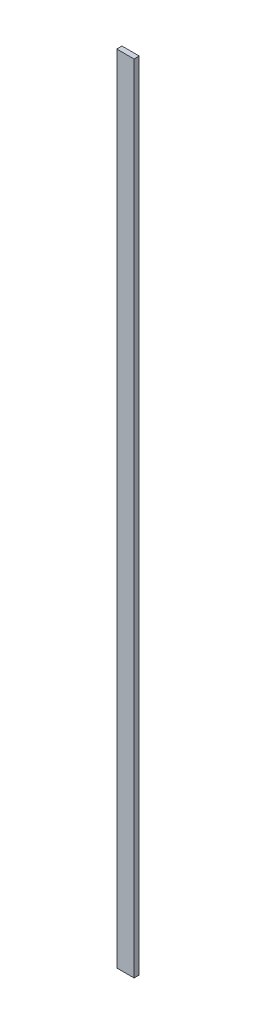
ISO-10303-21;
HEADER;
FILE_DESCRIPTION(('STEP AP214'),'2;1');
FILE_NAME('part.step','',(''),(''),'','','');
FILE_SCHEMA(('AUTOMOTIVE_DESIGN { 1 0 10303 214 1 1 1 1 }'));
ENDSEC;
DATA;
#1=APPLICATION_CONTEXT('core data for automotive mechanical design processes');
#2=APPLICATION_PROTOCOL_DEFINITION('international standard','automotive_design',2000,#1);
#3=PRODUCT_CONTEXT('',#1,'mechanical');
#4=PRODUCT('Part','Part','',(#3));
#5=PRODUCT_RELATED_PRODUCT_CATEGORY('part','',(#4));
#6=PRODUCT_DEFINITION_FORMATION('','',#4);
#7=PRODUCT_DEFINITION_CONTEXT('part definition',#1,'design');
#8=PRODUCT_DEFINITION('design','',#6,#7);
#9=PRODUCT_DEFINITION_SHAPE('','',#8);
#10=(LENGTH_UNIT() NAMED_UNIT(*) SI_UNIT(.MILLI.,.METRE.));
#11=(NAMED_UNIT(*) PLANE_ANGLE_UNIT() SI_UNIT($,.RADIAN.));
#12=(NAMED_UNIT(*) SI_UNIT($,.STERADIAN.) SOLID_ANGLE_UNIT());
#13=UNCERTAINTY_MEASURE_WITH_UNIT(LENGTH_MEASURE(1.E-05),#10,'distance_accuracy_value','');
#14=(GEOMETRIC_REPRESENTATION_CONTEXT(3) GLOBAL_UNCERTAINTY_ASSIGNED_CONTEXT((#13)) GLOBAL_UNIT_ASSIGNED_CONTEXT((#10,
#11,#12)) REPRESENTATION_CONTEXT('',''));
#15=CARTESIAN_POINT('',(0.,0.,0.));
#16=DIRECTION('',(0.,0.,1.));
#17=DIRECTION('',(1.,0.,0.));
#18=AXIS2_PLACEMENT_3D('',#15,#16,#17);
#19=CARTESIAN_POINT('',(-33.908474102077,12.9449766126216,3.));
#20=DIRECTION('',(0.,-1.,0.));
#21=DIRECTION('',(0.,0.,-1.));
#22=AXIS2_PLACEMENT_3D('',#19,#20,#21);
#23=PLANE('',#22);
#24=DIRECTION('',(-1.,0.,0.));
#25=VECTOR('',#24,1.);
#26=CARTESIAN_POINT('',(-33.908474102077,12.9449766126216,0.));
#27=LINE('',#26,#25);
#28=CARTESIAN_POINT('',(-23.908474102077,12.9449766126216,0.));
#29=VERTEX_POINT('',#28);
#30=CARTESIAN_POINT('',(-33.908474102077,12.9449766126216,0.));
#31=VERTEX_POINT('',#30);
#32=EDGE_CURVE('E96',#29,#31,#27,.T.);
#33=ORIENTED_EDGE('',*,*,#32,.T.);
#34=DIRECTION('',(0.,0.,-1.));
#35=VECTOR('',#34,1.);
#36=CARTESIAN_POINT('',(-33.908474102077,12.9449766126216,3.));
#37=LINE('',#36,#35);
#38=CARTESIAN_POINT('',(-33.908474102077,12.9449766126216,3.));
#39=VERTEX_POINT('',#38);
#40=EDGE_CURVE('E11',#39,#31,#37,.T.);
#41=ORIENTED_EDGE('',*,*,#40,.F.);
#42=DIRECTION('',(-1.,0.,0.));
#43=VECTOR('',#42,1.);
#44=CARTESIAN_POINT('',(-33.908474102077,12.9449766126216,3.));
#45=LINE('',#44,#43);
#46=CARTESIAN_POINT('',(-23.908474102077,12.9449766126216,3.));
#47=VERTEX_POINT('',#46);
#48=EDGE_CURVE('E84',#47,#39,#45,.T.);
#49=ORIENTED_EDGE('',*,*,#48,.F.);
#50=DIRECTION('',(0.,0.,-1.));
#51=VECTOR('',#50,1.);
#52=CARTESIAN_POINT('',(-23.908474102077,12.9449766126216,3.));
#53=LINE('',#52,#51);
#54=EDGE_CURVE('E92',#47,#29,#53,.T.);
#55=ORIENTED_EDGE('',*,*,#54,.T.);
#56=EDGE_LOOP('',(#33,#41,#49,#55));
#57=FACE_BOUND('',#56,.T.);
#58=ADVANCED_FACE('F33',(#57),#23,.F.);
#59=CARTESIAN_POINT('',(-33.908474102077,-447.055023387378,3.));
#60=DIRECTION('',(1.,0.,0.));
#61=DIRECTION('',(0.,1.,0.));
#62=AXIS2_PLACEMENT_3D('',#59,#60,#61);
#63=PLANE('',#62);
#64=DIRECTION('',(0.,-1.,0.));
#65=VECTOR('',#64,1.);
#66=CARTESIAN_POINT('',(-33.908474102077,-447.055023387378,0.));
#67=LINE('',#66,#65);
#68=CARTESIAN_POINT('',(-33.908474102077,-447.055023387378,0.));
#69=VERTEX_POINT('',#68);
#70=EDGE_CURVE('E88',#31,#69,#67,.T.);
#71=ORIENTED_EDGE('',*,*,#70,.T.);
#72=DIRECTION('',(0.,0.,-1.));
#73=VECTOR('',#72,1.);
#74=CARTESIAN_POINT('',(-33.908474102077,-447.055023387378,3.));
#75=LINE('',#74,#73);
#76=CARTESIAN_POINT('',(-33.908474102077,-447.055023387378,3.));
#77=VERTEX_POINT('',#76);
#78=EDGE_CURVE('E41',#77,#69,#75,.T.);
#79=ORIENTED_EDGE('',*,*,#78,.F.);
#80=DIRECTION('',(0.,-1.,0.));
#81=VECTOR('',#80,1.);
#82=CARTESIAN_POINT('',(-33.908474102077,-447.055023387378,3.));
#83=LINE('',#82,#81);
#84=EDGE_CURVE('E79',#39,#77,#83,.T.);
#85=ORIENTED_EDGE('',*,*,#84,.F.);
#86=ORIENTED_EDGE('',*,*,#40,.T.);
#87=EDGE_LOOP('',(#71,#79,#85,#86));
#88=FACE_BOUND('',#87,.T.);
#89=ADVANCED_FACE('F87',(#88),#63,.F.);
#90=CARTESIAN_POINT('',(-33.908474102077,-447.055023387378,3.));
#91=DIRECTION('',(0.,1.,0.));
#92=DIRECTION('',(0.,0.,1.));
#93=AXIS2_PLACEMENT_3D('',#90,#91,#92);
#94=PLANE('',#93);
#95=DIRECTION('',(1.,0.,0.));
#96=VECTOR('',#95,1.);
#97=CARTESIAN_POINT('',(-33.908474102077,-447.055023387378,0.));
#98=LINE('',#97,#96);
#99=CARTESIAN_POINT('',(-23.9084741020769,-447.055023387378,0.));
#100=VERTEX_POINT('',#99);
#101=EDGE_CURVE('E66',#69,#100,#98,.T.);
#102=ORIENTED_EDGE('',*,*,#101,.T.);
#103=DIRECTION('',(0.,0.,-1.));
#104=VECTOR('',#103,1.);
#105=CARTESIAN_POINT('',(-23.9084741020769,-447.055023387378,3.));
#106=LINE('',#105,#104);
#107=CARTESIAN_POINT('',(-23.9084741020769,-447.055023387378,3.));
#108=VERTEX_POINT('',#107);
#109=EDGE_CURVE('E89',#108,#100,#106,.T.);
#110=ORIENTED_EDGE('',*,*,#109,.F.);
#111=DIRECTION('',(1.,0.,0.));
#112=VECTOR('',#111,1.);
#113=CARTESIAN_POINT('',(-33.908474102077,-447.055023387378,3.));
#114=LINE('',#113,#112);
#115=EDGE_CURVE('E82',#77,#108,#114,.T.);
#116=ORIENTED_EDGE('',*,*,#115,.F.);
#117=ORIENTED_EDGE('',*,*,#78,.T.);
#118=EDGE_LOOP('',(#102,#110,#116,#117));
#119=FACE_BOUND('',#118,.T.);
#120=ADVANCED_FACE('F90',(#119),#94,.F.);
#121=CARTESIAN_POINT('',(-23.908474102077,12.9449766126216,3.));
#122=DIRECTION('',(-1.,0.,0.));
#123=DIRECTION('',(0.,-1.,0.));
#124=AXIS2_PLACEMENT_3D('',#121,#122,#123);
#125=PLANE('',#124);
#126=DIRECTION('',(0.,1.,0.));
#127=VECTOR('',#126,1.);
#128=CARTESIAN_POINT('',(-23.908474102077,12.9449766126216,0.));
#129=LINE('',#128,#127);
#130=EDGE_CURVE('E72',#100,#29,#129,.T.);
#131=ORIENTED_EDGE('',*,*,#130,.T.);
#132=ORIENTED_EDGE('',*,*,#54,.F.);
#133=DIRECTION('',(0.,1.,0.));
#134=VECTOR('',#133,1.);
#135=CARTESIAN_POINT('',(-23.908474102077,12.9449766126216,3.));
#136=LINE('',#135,#134);
#137=EDGE_CURVE('E49',#108,#47,#136,.T.);
#138=ORIENTED_EDGE('',*,*,#137,.F.);
#139=ORIENTED_EDGE('',*,*,#109,.T.);
#140=EDGE_LOOP('',(#131,#132,#138,#139));
#141=FACE_BOUND('',#140,.T.);
#142=ADVANCED_FACE('F103',(#141),#125,.F.);
#143=CARTESIAN_POINT('',(0.,0.,3.));
#144=DIRECTION('',(0.,0.,-1.));
#145=DIRECTION('',(-1.,0.,0.));
#146=AXIS2_PLACEMENT_3D('',#143,#144,#145);
#147=PLANE('',#146);
#148=ORIENTED_EDGE('',*,*,#48,.T.);
#149=ORIENTED_EDGE('',*,*,#84,.T.);
#150=ORIENTED_EDGE('',*,*,#115,.T.);
#151=ORIENTED_EDGE('',*,*,#137,.T.);
#152=EDGE_LOOP('',(#148,#149,#150,#151));
#153=FACE_BOUND('',#152,.T.);
#154=ADVANCED_FACE('F80',(#153),#147,.F.);
#155=CARTESIAN_POINT('',(0.,0.,0.));
#156=DIRECTION('',(0.,0.,-1.));
#157=DIRECTION('',(-1.,0.,0.));
#158=AXIS2_PLACEMENT_3D('',#155,#156,#157);
#159=PLANE('',#158);
#160=ORIENTED_EDGE('',*,*,#32,.F.);
#161=ORIENTED_EDGE('',*,*,#130,.F.);
#162=ORIENTED_EDGE('',*,*,#101,.F.);
#163=ORIENTED_EDGE('',*,*,#70,.F.);
#164=EDGE_LOOP('',(#160,#161,#162,#163));
#165=FACE_BOUND('',#164,.T.);
#166=ADVANCED_FACE('F106',(#165),#159,.T.);
#167=CLOSED_SHELL('',(#58,#89,#120,#142,#154,#166));
#168=MANIFOLD_SOLID_BREP('B2',#167);
#169=ADVANCED_BREP_SHAPE_REPRESENTATION('',(#18,#168),#14);
#170=SHAPE_DEFINITION_REPRESENTATION(#9,#169);
ENDSEC;
END-ISO-10303-21;
